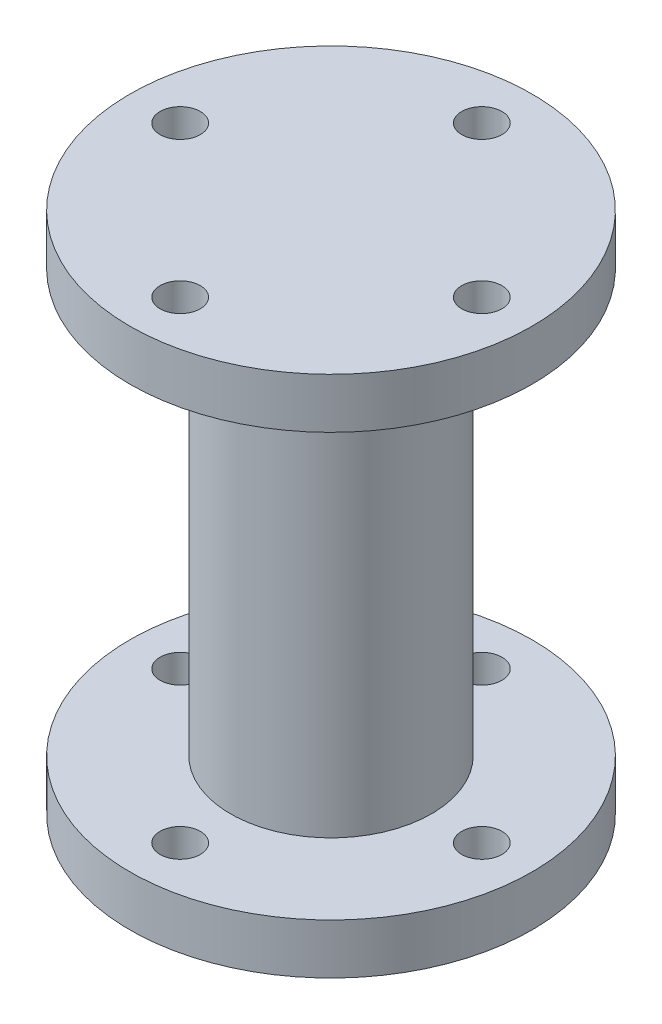
ISO-10303-21;
HEADER;
FILE_DESCRIPTION(('STEP AP214'),'2;1');
FILE_NAME('part.step','',(''),(''),'','','');
FILE_SCHEMA(('AUTOMOTIVE_DESIGN { 1 0 10303 214 1 1 1 1 }'));
ENDSEC;
DATA;
#1=APPLICATION_CONTEXT('core data for automotive mechanical design processes');
#2=APPLICATION_PROTOCOL_DEFINITION('international standard','automotive_design',2000,#1);
#3=PRODUCT_CONTEXT('',#1,'mechanical');
#4=PRODUCT('Part','Part','',(#3));
#5=PRODUCT_RELATED_PRODUCT_CATEGORY('part','',(#4));
#6=PRODUCT_DEFINITION_FORMATION('','',#4);
#7=PRODUCT_DEFINITION_CONTEXT('part definition',#1,'design');
#8=PRODUCT_DEFINITION('design','',#6,#7);
#9=PRODUCT_DEFINITION_SHAPE('','',#8);
#10=(LENGTH_UNIT() NAMED_UNIT(*) SI_UNIT(.MILLI.,.METRE.));
#11=(NAMED_UNIT(*) PLANE_ANGLE_UNIT() SI_UNIT($,.RADIAN.));
#12=(NAMED_UNIT(*) SI_UNIT($,.STERADIAN.) SOLID_ANGLE_UNIT());
#13=UNCERTAINTY_MEASURE_WITH_UNIT(LENGTH_MEASURE(1.E-05),#10,'distance_accuracy_value','');
#14=(GEOMETRIC_REPRESENTATION_CONTEXT(3) GLOBAL_UNCERTAINTY_ASSIGNED_CONTEXT((#13)) GLOBAL_UNIT_ASSIGNED_CONTEXT((#10,
#11,#12)) REPRESENTATION_CONTEXT('',''));
#15=CARTESIAN_POINT('',(0.,0.,0.));
#16=DIRECTION('',(0.,0.,1.));
#17=DIRECTION('',(1.,0.,0.));
#18=AXIS2_PLACEMENT_3D('',#15,#16,#17);
#19=CARTESIAN_POINT('',(0.,-47.,0.));
#20=DIRECTION('',(0.,-1.,0.));
#21=DIRECTION('',(0.,0.,-1.));
#22=AXIS2_PLACEMENT_3D('',#19,#20,#21);
#23=PLANE('',#22);
#24=CARTESIAN_POINT('',(15.,-47.,0.));
#25=DIRECTION('',(0.,-1.,0.));
#26=DIRECTION('',(0.,0.,-1.));
#27=AXIS2_PLACEMENT_3D('',#24,#25,#26);
#28=CIRCLE('',#27,2.);
#29=CARTESIAN_POINT('',(15.,-47.,-2.));
#30=VERTEX_POINT('',#29);
#31=EDGE_CURVE('E71',#30,#30,#28,.T.);
#32=ORIENTED_EDGE('',*,*,#31,.F.);
#33=EDGE_LOOP('',(#32));
#34=FACE_BOUND('',#33,.T.);
#35=CARTESIAN_POINT('',(-15.,-47.,0.));
#36=DIRECTION('',(0.,-1.,0.));
#37=DIRECTION('',(0.,0.,-1.));
#38=AXIS2_PLACEMENT_3D('',#35,#36,#37);
#39=CIRCLE('',#38,2.);
#40=CARTESIAN_POINT('',(-15.,-47.,-2.));
#41=VERTEX_POINT('',#40);
#42=EDGE_CURVE('E59',#41,#41,#39,.T.);
#43=ORIENTED_EDGE('',*,*,#42,.F.);
#44=EDGE_LOOP('',(#43));
#45=FACE_BOUND('',#44,.T.);
#46=CARTESIAN_POINT('',(0.,-47.,0.));
#47=DIRECTION('',(0.,-1.,0.));
#48=DIRECTION('',(0.,0.,-1.));
#49=AXIS2_PLACEMENT_3D('',#46,#47,#48);
#50=CIRCLE('',#49,20.);
#51=CARTESIAN_POINT('',(0.,-47.,-20.));
#52=VERTEX_POINT('',#51);
#53=EDGE_CURVE('E11',#52,#52,#50,.T.);
#54=ORIENTED_EDGE('',*,*,#53,.T.);
#55=EDGE_LOOP('',(#54));
#56=FACE_BOUND('',#55,.T.);
#57=CARTESIAN_POINT('',(0.,-47.,0.));
#58=DIRECTION('',(0.,-1.,0.));
#59=DIRECTION('',(0.,0.,-1.));
#60=AXIS2_PLACEMENT_3D('',#57,#58,#59);
#61=CIRCLE('',#60,10.);
#62=CARTESIAN_POINT('',(0.,-47.,-10.));
#63=VERTEX_POINT('',#62);
#64=EDGE_CURVE('E54',#63,#63,#61,.T.);
#65=ORIENTED_EDGE('',*,*,#64,.F.);
#66=EDGE_LOOP('',(#65));
#67=FACE_BOUND('',#66,.T.);
#68=CARTESIAN_POINT('',(0.,-47.,-15.));
#69=DIRECTION('',(0.,-1.,0.));
#70=DIRECTION('',(0.,0.,-1.));
#71=AXIS2_PLACEMENT_3D('',#68,#69,#70);
#72=CIRCLE('',#71,2.);
#73=CARTESIAN_POINT('',(0.,-47.,-17.));
#74=VERTEX_POINT('',#73);
#75=EDGE_CURVE('E65',#74,#74,#72,.T.);
#76=ORIENTED_EDGE('',*,*,#75,.F.);
#77=EDGE_LOOP('',(#76));
#78=FACE_BOUND('',#77,.T.);
#79=CARTESIAN_POINT('',(0.,-47.,15.));
#80=DIRECTION('',(0.,-1.,0.));
#81=DIRECTION('',(0.,0.,-1.));
#82=AXIS2_PLACEMENT_3D('',#79,#80,#81);
#83=CIRCLE('',#82,2.);
#84=CARTESIAN_POINT('',(0.,-47.,13.));
#85=VERTEX_POINT('',#84);
#86=EDGE_CURVE('E77',#85,#85,#83,.T.);
#87=ORIENTED_EDGE('',*,*,#86,.F.);
#88=EDGE_LOOP('',(#87));
#89=FACE_BOUND('',#88,.T.);
#90=ADVANCED_FACE('F43',(#34,#45,#56,#67,#78,#89),#23,.T.);
#91=CARTESIAN_POINT('',(0.,-42.,0.));
#92=DIRECTION('',(0.,-1.,0.));
#93=DIRECTION('',(0.,0.,-1.));
#94=AXIS2_PLACEMENT_3D('',#91,#92,#93);
#95=PLANE('',#94);
#96=CARTESIAN_POINT('',(0.,-42.,0.));
#97=DIRECTION('',(0.,-1.,0.));
#98=DIRECTION('',(0.,0.,-1.));
#99=AXIS2_PLACEMENT_3D('',#96,#97,#98);
#100=CIRCLE('',#99,20.);
#101=CARTESIAN_POINT('',(0.,-42.,-20.));
#102=VERTEX_POINT('',#101);
#103=EDGE_CURVE('E47',#102,#102,#100,.T.);
#104=ORIENTED_EDGE('',*,*,#103,.F.);
#105=EDGE_LOOP('',(#104));
#106=FACE_BOUND('',#105,.T.);
#107=CARTESIAN_POINT('',(0.,-42.,0.));
#108=DIRECTION('',(0.,-1.,0.));
#109=DIRECTION('',(0.,0.,-1.));
#110=AXIS2_PLACEMENT_3D('',#107,#108,#109);
#111=CIRCLE('',#110,10.);
#112=CARTESIAN_POINT('',(0.,-42.,-10.));
#113=VERTEX_POINT('',#112);
#114=EDGE_CURVE('E56',#113,#113,#111,.T.);
#115=ORIENTED_EDGE('',*,*,#114,.T.);
#116=EDGE_LOOP('',(#115));
#117=FACE_BOUND('',#116,.T.);
#118=CARTESIAN_POINT('',(-15.,-42.,0.));
#119=DIRECTION('',(0.,-1.,0.));
#120=DIRECTION('',(0.,0.,-1.));
#121=AXIS2_PLACEMENT_3D('',#118,#119,#120);
#122=CIRCLE('',#121,2.);
#123=CARTESIAN_POINT('',(-15.,-42.,-2.));
#124=VERTEX_POINT('',#123);
#125=EDGE_CURVE('E62',#124,#124,#122,.T.);
#126=ORIENTED_EDGE('',*,*,#125,.T.);
#127=EDGE_LOOP('',(#126));
#128=FACE_BOUND('',#127,.T.);
#129=CARTESIAN_POINT('',(0.,-42.,-15.));
#130=DIRECTION('',(0.,-1.,0.));
#131=DIRECTION('',(0.,0.,-1.));
#132=AXIS2_PLACEMENT_3D('',#129,#130,#131);
#133=CIRCLE('',#132,2.);
#134=CARTESIAN_POINT('',(0.,-42.,-17.));
#135=VERTEX_POINT('',#134);
#136=EDGE_CURVE('E68',#135,#135,#133,.T.);
#137=ORIENTED_EDGE('',*,*,#136,.T.);
#138=EDGE_LOOP('',(#137));
#139=FACE_BOUND('',#138,.T.);
#140=CARTESIAN_POINT('',(15.,-42.,0.));
#141=DIRECTION('',(0.,-1.,0.));
#142=DIRECTION('',(0.,0.,-1.));
#143=AXIS2_PLACEMENT_3D('',#140,#141,#142);
#144=CIRCLE('',#143,2.);
#145=CARTESIAN_POINT('',(15.,-42.,-2.));
#146=VERTEX_POINT('',#145);
#147=EDGE_CURVE('E74',#146,#146,#144,.T.);
#148=ORIENTED_EDGE('',*,*,#147,.T.);
#149=EDGE_LOOP('',(#148));
#150=FACE_BOUND('',#149,.T.);
#151=CARTESIAN_POINT('',(0.,-42.,15.));
#152=DIRECTION('',(0.,-1.,0.));
#153=DIRECTION('',(0.,0.,-1.));
#154=AXIS2_PLACEMENT_3D('',#151,#152,#153);
#155=CIRCLE('',#154,2.);
#156=CARTESIAN_POINT('',(0.,-42.,13.));
#157=VERTEX_POINT('',#156);
#158=EDGE_CURVE('E80',#157,#157,#155,.T.);
#159=ORIENTED_EDGE('',*,*,#158,.T.);
#160=EDGE_LOOP('',(#159));
#161=FACE_BOUND('',#160,.T.);
#162=ADVANCED_FACE('F90',(#106,#117,#128,#139,#150,#161),#95,.F.);
#163=CARTESIAN_POINT('',(0.,-47.,0.));
#164=DIRECTION('',(0.,1.,0.));
#165=DIRECTION('',(0.,0.,1.));
#166=AXIS2_PLACEMENT_3D('',#163,#164,#165);
#167=CYLINDRICAL_SURFACE('',#166,20.);
#168=ORIENTED_EDGE('',*,*,#53,.F.);
#169=EDGE_LOOP('',(#168));
#170=FACE_BOUND('',#169,.T.);
#171=ORIENTED_EDGE('',*,*,#103,.T.);
#172=EDGE_LOOP('',(#171));
#173=FACE_BOUND('',#172,.T.);
#174=ADVANCED_FACE('F45',(#170,#173),#167,.T.);
#175=CARTESIAN_POINT('',(0.,-47.,0.));
#176=DIRECTION('',(0.,1.,0.));
#177=DIRECTION('',(0.,0.,1.));
#178=AXIS2_PLACEMENT_3D('',#175,#176,#177);
#179=CYLINDRICAL_SURFACE('',#178,10.);
#180=ORIENTED_EDGE('',*,*,#64,.T.);
#181=EDGE_LOOP('',(#180));
#182=FACE_BOUND('',#181,.T.);
#183=ORIENTED_EDGE('',*,*,#114,.F.);
#184=EDGE_LOOP('',(#183));
#185=FACE_BOUND('',#184,.T.);
#186=ADVANCED_FACE('F100',(#182,#185),#179,.F.);
#187=CARTESIAN_POINT('',(-15.,-47.,0.));
#188=DIRECTION('',(0.,1.,0.));
#189=DIRECTION('',(0.,0.,1.));
#190=AXIS2_PLACEMENT_3D('',#187,#188,#189);
#191=CYLINDRICAL_SURFACE('',#190,2.);
#192=ORIENTED_EDGE('',*,*,#42,.T.);
#193=EDGE_LOOP('',(#192));
#194=FACE_BOUND('',#193,.T.);
#195=ORIENTED_EDGE('',*,*,#125,.F.);
#196=EDGE_LOOP('',(#195));
#197=FACE_BOUND('',#196,.T.);
#198=ADVANCED_FACE('F103',(#194,#197),#191,.F.);
#199=CARTESIAN_POINT('',(0.,-47.,-15.));
#200=DIRECTION('',(0.,1.,0.));
#201=DIRECTION('',(0.,0.,1.));
#202=AXIS2_PLACEMENT_3D('',#199,#200,#201);
#203=CYLINDRICAL_SURFACE('',#202,2.);
#204=ORIENTED_EDGE('',*,*,#75,.T.);
#205=EDGE_LOOP('',(#204));
#206=FACE_BOUND('',#205,.T.);
#207=ORIENTED_EDGE('',*,*,#136,.F.);
#208=EDGE_LOOP('',(#207));
#209=FACE_BOUND('',#208,.T.);
#210=ADVANCED_FACE('F107',(#206,#209),#203,.F.);
#211=CARTESIAN_POINT('',(15.,-47.,0.));
#212=DIRECTION('',(0.,1.,0.));
#213=DIRECTION('',(0.,0.,1.));
#214=AXIS2_PLACEMENT_3D('',#211,#212,#213);
#215=CYLINDRICAL_SURFACE('',#214,2.);
#216=ORIENTED_EDGE('',*,*,#31,.T.);
#217=EDGE_LOOP('',(#216));
#218=FACE_BOUND('',#217,.T.);
#219=ORIENTED_EDGE('',*,*,#147,.F.);
#220=EDGE_LOOP('',(#219));
#221=FACE_BOUND('',#220,.T.);
#222=ADVANCED_FACE('F111',(#218,#221),#215,.F.);
#223=CARTESIAN_POINT('',(0.,-47.,15.));
#224=DIRECTION('',(0.,1.,0.));
#225=DIRECTION('',(0.,0.,1.));
#226=AXIS2_PLACEMENT_3D('',#223,#224,#225);
#227=CYLINDRICAL_SURFACE('',#226,2.);
#228=ORIENTED_EDGE('',*,*,#86,.T.);
#229=EDGE_LOOP('',(#228));
#230=FACE_BOUND('',#229,.T.);
#231=ORIENTED_EDGE('',*,*,#158,.F.);
#232=EDGE_LOOP('',(#231));
#233=FACE_BOUND('',#232,.T.);
#234=ADVANCED_FACE('F86',(#230,#233),#227,.F.);
#235=CLOSED_SHELL('',(#90,#162,#174,#186,#198,#210,#222,#234));
#236=MANIFOLD_SOLID_BREP('B2',#235);
#237=CARTESIAN_POINT('',(0.,5.,0.));
#238=DIRECTION('',(0.,1.,0.));
#239=DIRECTION('',(0.,0.,1.));
#240=AXIS2_PLACEMENT_3D('',#237,#238,#239);
#241=PLANE('',#240);
#242=CARTESIAN_POINT('',(0.,5.,15.));
#243=DIRECTION('',(0.,1.,0.));
#244=DIRECTION('',(0.,0.,1.));
#245=AXIS2_PLACEMENT_3D('',#242,#243,#244);
#246=CIRCLE('',#245,2.);
#247=CARTESIAN_POINT('',(0.,5.,17.));
#248=VERTEX_POINT('',#247);
#249=EDGE_CURVE('E228',#248,#248,#246,.T.);
#250=ORIENTED_EDGE('',*,*,#249,.F.);
#251=EDGE_LOOP('',(#250));
#252=FACE_BOUND('',#251,.T.);
#253=CARTESIAN_POINT('',(0.,5.,-15.));
#254=DIRECTION('',(0.,1.,0.));
#255=DIRECTION('',(0.,0.,1.));
#256=AXIS2_PLACEMENT_3D('',#253,#254,#255);
#257=CIRCLE('',#256,2.);
#258=CARTESIAN_POINT('',(0.,5.,-13.));
#259=VERTEX_POINT('',#258);
#260=EDGE_CURVE('E240',#259,#259,#257,.T.);
#261=ORIENTED_EDGE('',*,*,#260,.F.);
#262=EDGE_LOOP('',(#261));
#263=FACE_BOUND('',#262,.T.);
#264=CARTESIAN_POINT('',(0.,5.,0.));
#265=DIRECTION('',(0.,1.,0.));
#266=DIRECTION('',(0.,0.,1.));
#267=AXIS2_PLACEMENT_3D('',#264,#265,#266);
#268=CIRCLE('',#267,20.);
#269=CARTESIAN_POINT('',(0.,5.,20.));
#270=VERTEX_POINT('',#269);
#271=EDGE_CURVE('E213',#270,#270,#268,.T.);
#272=ORIENTED_EDGE('',*,*,#271,.T.);
#273=EDGE_LOOP('',(#272));
#274=FACE_BOUND('',#273,.T.);
#275=CARTESIAN_POINT('',(15.,5.,0.));
#276=DIRECTION('',(0.,1.,0.));
#277=DIRECTION('',(0.,0.,1.));
#278=AXIS2_PLACEMENT_3D('',#275,#276,#277);
#279=CIRCLE('',#278,2.);
#280=CARTESIAN_POINT('',(15.,5.,2.));
#281=VERTEX_POINT('',#280);
#282=EDGE_CURVE('E234',#281,#281,#279,.T.);
#283=ORIENTED_EDGE('',*,*,#282,.F.);
#284=EDGE_LOOP('',(#283));
#285=FACE_BOUND('',#284,.T.);
#286=CARTESIAN_POINT('',(-15.,5.,0.));
#287=DIRECTION('',(0.,1.,0.));
#288=DIRECTION('',(0.,0.,1.));
#289=AXIS2_PLACEMENT_3D('',#286,#287,#288);
#290=CIRCLE('',#289,2.);
#291=CARTESIAN_POINT('',(-15.,5.,2.));
#292=VERTEX_POINT('',#291);
#293=EDGE_CURVE('E221',#292,#292,#290,.T.);
#294=ORIENTED_EDGE('',*,*,#293,.F.);
#295=EDGE_LOOP('',(#294));
#296=FACE_BOUND('',#295,.T.);
#297=ADVANCED_FACE('F205',(#252,#263,#274,#285,#296),#241,.T.);
#298=CARTESIAN_POINT('',(0.,0.,0.));
#299=DIRECTION('',(0.,1.,0.));
#300=DIRECTION('',(0.,0.,1.));
#301=AXIS2_PLACEMENT_3D('',#298,#299,#300);
#302=PLANE('',#301);
#303=CARTESIAN_POINT('',(0.,0.,0.));
#304=DIRECTION('',(0.,-1.,0.));
#305=DIRECTION('',(0.,0.,-1.));
#306=AXIS2_PLACEMENT_3D('',#303,#304,#305);
#307=CIRCLE('',#306,10.);
#308=CARTESIAN_POINT('',(0.,0.,-10.));
#309=VERTEX_POINT('',#308);
#310=EDGE_CURVE('E42',#309,#309,#307,.T.);
#311=ORIENTED_EDGE('',*,*,#310,.F.);
#312=EDGE_LOOP('',(#311));
#313=FACE_BOUND('',#312,.T.);
#314=CARTESIAN_POINT('',(0.,0.,0.));
#315=DIRECTION('',(0.,1.,0.));
#316=DIRECTION('',(0.,0.,1.));
#317=AXIS2_PLACEMENT_3D('',#314,#315,#316);
#318=CIRCLE('',#317,20.);
#319=CARTESIAN_POINT('',(0.,0.,20.));
#320=VERTEX_POINT('',#319);
#321=EDGE_CURVE('E209',#320,#320,#318,.T.);
#322=ORIENTED_EDGE('',*,*,#321,.F.);
#323=EDGE_LOOP('',(#322));
#324=FACE_BOUND('',#323,.T.);
#325=CARTESIAN_POINT('',(0.,0.,-15.));
#326=DIRECTION('',(0.,1.,0.));
#327=DIRECTION('',(0.,0.,1.));
#328=AXIS2_PLACEMENT_3D('',#325,#326,#327);
#329=CIRCLE('',#328,2.);
#330=CARTESIAN_POINT('',(0.,0.,-13.));
#331=VERTEX_POINT('',#330);
#332=EDGE_CURVE('E237',#331,#331,#329,.T.);
#333=ORIENTED_EDGE('',*,*,#332,.T.);
#334=EDGE_LOOP('',(#333));
#335=FACE_BOUND('',#334,.T.);
#336=CARTESIAN_POINT('',(15.,0.,0.));
#337=DIRECTION('',(0.,1.,0.));
#338=DIRECTION('',(0.,0.,1.));
#339=AXIS2_PLACEMENT_3D('',#336,#337,#338);
#340=CIRCLE('',#339,2.);
#341=CARTESIAN_POINT('',(15.,0.,2.));
#342=VERTEX_POINT('',#341);
#343=EDGE_CURVE('E231',#342,#342,#340,.T.);
#344=ORIENTED_EDGE('',*,*,#343,.T.);
#345=EDGE_LOOP('',(#344));
#346=FACE_BOUND('',#345,.T.);
#347=CARTESIAN_POINT('',(0.,0.,15.));
#348=DIRECTION('',(0.,1.,0.));
#349=DIRECTION('',(0.,0.,1.));
#350=AXIS2_PLACEMENT_3D('',#347,#348,#349);
#351=CIRCLE('',#350,2.);
#352=CARTESIAN_POINT('',(0.,0.,17.));
#353=VERTEX_POINT('',#352);
#354=EDGE_CURVE('E224',#353,#353,#351,.T.);
#355=ORIENTED_EDGE('',*,*,#354,.T.);
#356=EDGE_LOOP('',(#355));
#357=FACE_BOUND('',#356,.T.);
#358=CARTESIAN_POINT('',(-15.,0.,0.));
#359=DIRECTION('',(0.,1.,0.));
#360=DIRECTION('',(0.,0.,1.));
#361=AXIS2_PLACEMENT_3D('',#358,#359,#360);
#362=CIRCLE('',#361,2.);
#363=CARTESIAN_POINT('',(-15.,0.,2.));
#364=VERTEX_POINT('',#363);
#365=EDGE_CURVE('E225',#364,#364,#362,.T.);
#366=ORIENTED_EDGE('',*,*,#365,.T.);
#367=EDGE_LOOP('',(#366));
#368=FACE_BOUND('',#367,.T.);
#369=ADVANCED_FACE('F246',(#313,#324,#335,#346,#357,#368),#302,.F.);
#370=CARTESIAN_POINT('',(0.,5.,0.));
#371=DIRECTION('',(0.,-1.,0.));
#372=DIRECTION('',(0.,0.,-1.));
#373=AXIS2_PLACEMENT_3D('',#370,#371,#372);
#374=CYLINDRICAL_SURFACE('',#373,20.);
#375=ORIENTED_EDGE('',*,*,#271,.F.);
#376=EDGE_LOOP('',(#375));
#377=FACE_BOUND('',#376,.T.);
#378=ORIENTED_EDGE('',*,*,#321,.T.);
#379=EDGE_LOOP('',(#378));
#380=FACE_BOUND('',#379,.T.);
#381=ADVANCED_FACE('F207',(#377,#380),#374,.T.);
#382=CARTESIAN_POINT('',(0.,5.,-15.));
#383=DIRECTION('',(0.,-1.,0.));
#384=DIRECTION('',(0.,0.,-1.));
#385=AXIS2_PLACEMENT_3D('',#382,#383,#384);
#386=CYLINDRICAL_SURFACE('',#385,2.);
#387=ORIENTED_EDGE('',*,*,#260,.T.);
#388=EDGE_LOOP('',(#387));
#389=FACE_BOUND('',#388,.T.);
#390=ORIENTED_EDGE('',*,*,#332,.F.);
#391=EDGE_LOOP('',(#390));
#392=FACE_BOUND('',#391,.T.);
#393=ADVANCED_FACE('F249',(#389,#392),#386,.F.);
#394=CARTESIAN_POINT('',(15.,5.,0.));
#395=DIRECTION('',(0.,-1.,0.));
#396=DIRECTION('',(0.,0.,-1.));
#397=AXIS2_PLACEMENT_3D('',#394,#395,#396);
#398=CYLINDRICAL_SURFACE('',#397,2.);
#399=ORIENTED_EDGE('',*,*,#282,.T.);
#400=EDGE_LOOP('',(#399));
#401=FACE_BOUND('',#400,.T.);
#402=ORIENTED_EDGE('',*,*,#343,.F.);
#403=EDGE_LOOP('',(#402));
#404=FACE_BOUND('',#403,.T.);
#405=ADVANCED_FACE('F251',(#401,#404),#398,.F.);
#406=CARTESIAN_POINT('',(0.,5.,15.));
#407=DIRECTION('',(0.,-1.,0.));
#408=DIRECTION('',(0.,0.,-1.));
#409=AXIS2_PLACEMENT_3D('',#406,#407,#408);
#410=CYLINDRICAL_SURFACE('',#409,2.);
#411=ORIENTED_EDGE('',*,*,#249,.T.);
#412=EDGE_LOOP('',(#411));
#413=FACE_BOUND('',#412,.T.);
#414=ORIENTED_EDGE('',*,*,#354,.F.);
#415=EDGE_LOOP('',(#414));
#416=FACE_BOUND('',#415,.T.);
#417=ADVANCED_FACE('F258',(#413,#416),#410,.F.);
#418=CARTESIAN_POINT('',(-15.,5.,0.));
#419=DIRECTION('',(0.,-1.,0.));
#420=DIRECTION('',(0.,0.,-1.));
#421=AXIS2_PLACEMENT_3D('',#418,#419,#420);
#422=CYLINDRICAL_SURFACE('',#421,2.);
#423=ORIENTED_EDGE('',*,*,#293,.T.);
#424=EDGE_LOOP('',(#423));
#425=FACE_BOUND('',#424,.T.);
#426=ORIENTED_EDGE('',*,*,#365,.F.);
#427=EDGE_LOOP('',(#426));
#428=FACE_BOUND('',#427,.T.);
#429=ADVANCED_FACE('F279',(#425,#428),#422,.F.);
#430=CARTESIAN_POINT('',(0.,-42.,0.));
#431=DIRECTION('',(0.,1.,0.));
#432=DIRECTION('',(0.,0.,1.));
#433=AXIS2_PLACEMENT_3D('',#430,#431,#432);
#434=CYLINDRICAL_SURFACE('',#433,10.);
#435=CARTESIAN_POINT('',(0.,-42.,0.));
#436=DIRECTION('',(0.,-1.,0.));
#437=DIRECTION('',(0.,0.,-1.));
#438=AXIS2_PLACEMENT_3D('',#435,#436,#437);
#439=CIRCLE('',#438,10.);
#440=CARTESIAN_POINT('',(0.,-42.,-10.));
#441=VERTEX_POINT('',#440);
#442=EDGE_CURVE('E220',#441,#441,#439,.T.);
#443=ORIENTED_EDGE('',*,*,#442,.F.);
#444=EDGE_LOOP('',(#443));
#445=FACE_BOUND('',#444,.T.);
#446=ORIENTED_EDGE('',*,*,#310,.T.);
#447=EDGE_LOOP('',(#446));
#448=FACE_BOUND('',#447,.T.);
#449=ADVANCED_FACE('F282',(#445,#448),#434,.T.);
#450=CARTESIAN_POINT('',(0.,-42.,0.));
#451=DIRECTION('',(0.,-1.,0.));
#452=DIRECTION('',(0.,0.,-1.));
#453=AXIS2_PLACEMENT_3D('',#450,#451,#452);
#454=PLANE('',#453);
#455=ORIENTED_EDGE('',*,*,#442,.T.);
#456=EDGE_LOOP('',(#455));
#457=FACE_BOUND('',#456,.T.);
#458=ADVANCED_FACE('F290',(#457),#454,.T.);
#459=CLOSED_SHELL('',(#297,#369,#381,#393,#405,#417,#429,#449,#458));
#460=MANIFOLD_SOLID_BREP('B6',#459);
#461=ADVANCED_BREP_SHAPE_REPRESENTATION('',(#18,#236,#460),#14);
#462=SHAPE_DEFINITION_REPRESENTATION(#9,#461);
ENDSEC;
END-ISO-10303-21;
